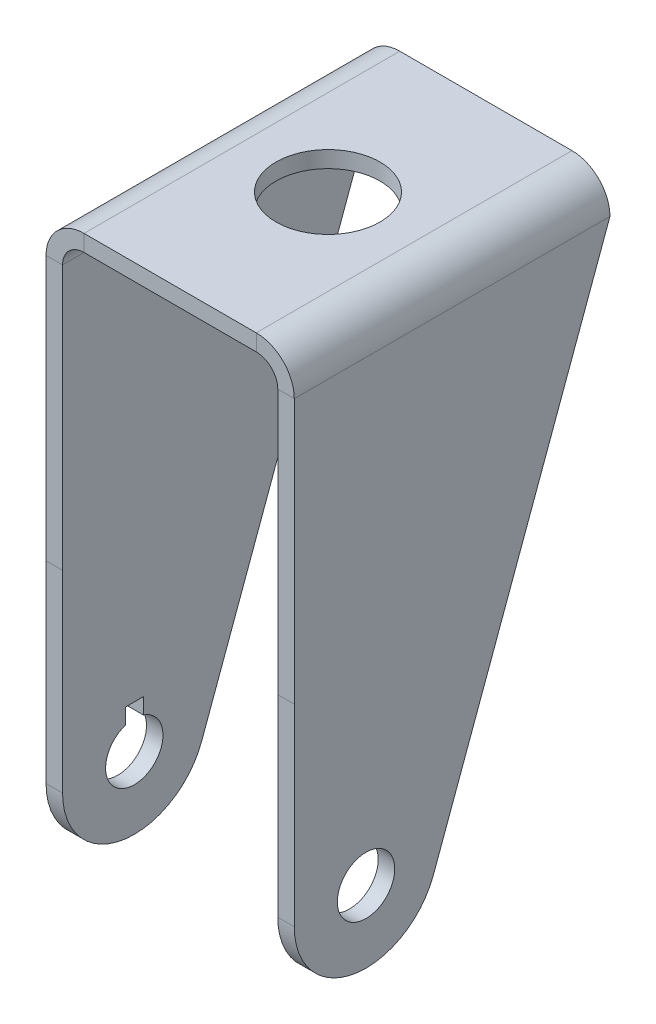
ISO-10303-21;
HEADER;
FILE_DESCRIPTION(('STEP AP214'),'2;1');
FILE_NAME('part.step','',(''),(''),'','','');
FILE_SCHEMA(('AUTOMOTIVE_DESIGN { 1 0 10303 214 1 1 1 1 }'));
ENDSEC;
DATA;
#1=APPLICATION_CONTEXT('core data for automotive mechanical design processes');
#2=APPLICATION_PROTOCOL_DEFINITION('international standard','automotive_design',2000,#1);
#3=PRODUCT_CONTEXT('',#1,'mechanical');
#4=PRODUCT('Part','Part','',(#3));
#5=PRODUCT_RELATED_PRODUCT_CATEGORY('part','',(#4));
#6=PRODUCT_DEFINITION_FORMATION('','',#4);
#7=PRODUCT_DEFINITION_CONTEXT('part definition',#1,'design');
#8=PRODUCT_DEFINITION('design','',#6,#7);
#9=PRODUCT_DEFINITION_SHAPE('','',#8);
#10=(LENGTH_UNIT() NAMED_UNIT(*) SI_UNIT(.MILLI.,.METRE.));
#11=(NAMED_UNIT(*) PLANE_ANGLE_UNIT() SI_UNIT($,.RADIAN.));
#12=(NAMED_UNIT(*) SI_UNIT($,.STERADIAN.) SOLID_ANGLE_UNIT());
#13=UNCERTAINTY_MEASURE_WITH_UNIT(LENGTH_MEASURE(1.E-05),#10,'distance_accuracy_value','');
#14=(GEOMETRIC_REPRESENTATION_CONTEXT(3) GLOBAL_UNCERTAINTY_ASSIGNED_CONTEXT((#13)) GLOBAL_UNIT_ASSIGNED_CONTEXT((#10,
#11,#12)) REPRESENTATION_CONTEXT('',''));
#15=CARTESIAN_POINT('',(0.,0.,0.));
#16=DIRECTION('',(0.,0.,1.));
#17=DIRECTION('',(1.,0.,0.));
#18=AXIS2_PLACEMENT_3D('',#15,#16,#17);
#19=CARTESIAN_POINT('',(-12.,79.05,44.));
#20=DIRECTION('',(0.,0.,1.));
#21=DIRECTION('',(1.,0.,0.));
#22=AXIS2_PLACEMENT_3D('',#19,#20,#21);
#23=PLANE('',#22);
#24=DIRECTION('',(0.,1.,0.));
#25=VECTOR('',#24,1.);
#26=CARTESIAN_POINT('',(-17.3,76.75,44.));
#27=LINE('',#26,#25);
#28=CARTESIAN_POINT('',(-17.3,36.875,44.));
#29=VERTEX_POINT('',#28);
#30=CARTESIAN_POINT('',(-17.3,73.75,44.));
#31=VERTEX_POINT('',#30);
#32=EDGE_CURVE('E251',#29,#31,#27,.T.);
#33=ORIENTED_EDGE('',*,*,#32,.F.);
#34=DIRECTION('',(1.,0.,0.));
#35=VECTOR('',#34,1.);
#36=CARTESIAN_POINT('',(-12.,36.875,44.));
#37=LINE('',#36,#35);
#38=CARTESIAN_POINT('',(-15.,36.875,44.));
#39=VERTEX_POINT('',#38);
#40=EDGE_CURVE('E64',#29,#39,#37,.T.);
#41=ORIENTED_EDGE('',*,*,#40,.T.);
#42=DIRECTION('',(0.,1.,0.));
#43=VECTOR('',#42,1.);
#44=CARTESIAN_POINT('',(-15.,76.75,44.));
#45=LINE('',#44,#43);
#46=CARTESIAN_POINT('',(-15.,73.75,44.));
#47=VERTEX_POINT('',#46);
#48=EDGE_CURVE('E254',#39,#47,#45,.T.);
#49=ORIENTED_EDGE('',*,*,#48,.T.);
#50=DIRECTION('',(-1.,0.,0.));
#51=VECTOR('',#50,1.);
#52=CARTESIAN_POINT('',(-15.,73.75,44.));
#53=LINE('',#52,#51);
#54=EDGE_CURVE('E321',#47,#31,#53,.T.);
#55=ORIENTED_EDGE('',*,*,#54,.T.);
#56=EDGE_LOOP('',(#33,#41,#49,#55));
#57=FACE_BOUND('',#56,.T.);
#58=ADVANCED_FACE('F41',(#57),#23,.T.);
#59=CARTESIAN_POINT('',(15.,76.75,44.));
#60=DIRECTION('',(1.,0.,0.));
#61=DIRECTION('',(0.,1.,0.));
#62=AXIS2_PLACEMENT_3D('',#59,#60,#61);
#63=PLANE('',#62);
#64=CARTESIAN_POINT('',(15.,9.99999999999999,34.));
#65=DIRECTION('',(1.,0.,0.));
#66=DIRECTION('',(0.,1.,0.));
#67=AXIS2_PLACEMENT_3D('',#64,#65,#66);
#68=CIRCLE('',#67,4.);
#69=CARTESIAN_POINT('',(15.,14.,34.));
#70=VERTEX_POINT('',#69);
#71=EDGE_CURVE('E205',#70,#70,#68,.T.);
#72=ORIENTED_EDGE('',*,*,#71,.T.);
#73=EDGE_LOOP('',(#72));
#74=FACE_BOUND('',#73,.T.);
#75=DIRECTION('',(0.,0.938993836890136,-0.343933967910034));
#76=VECTOR('',#75,1.);
#77=CARTESIAN_POINT('',(15.,62.1852457259066,4.23592963992889));
#78=LINE('',#77,#76);
#79=CARTESIAN_POINT('',(15.,6.56066032089966,24.6100616310986));
#80=VERTEX_POINT('',#79);
#81=CARTESIAN_POINT('',(15.,73.75,0.));
#82=VERTEX_POINT('',#81);
#83=EDGE_CURVE('E222',#80,#82,#78,.T.);
#84=ORIENTED_EDGE('',*,*,#83,.F.);
#85=CARTESIAN_POINT('',(15.,9.99999999999999,34.));
#86=DIRECTION('',(1.,0.,0.));
#87=DIRECTION('',(0.,1.,0.));
#88=AXIS2_PLACEMENT_3D('',#85,#86,#87);
#89=CIRCLE('',#88,9.99999999999999);
#90=CARTESIAN_POINT('',(15.,9.99999999999999,44.));
#91=VERTEX_POINT('',#90);
#92=EDGE_CURVE('E231',#91,#80,#89,.T.);
#93=ORIENTED_EDGE('',*,*,#92,.F.);
#94=DIRECTION('',(0.,-1.,0.));
#95=VECTOR('',#94,1.);
#96=CARTESIAN_POINT('',(15.,76.75,44.));
#97=LINE('',#96,#95);
#98=CARTESIAN_POINT('',(15.,36.875,44.));
#99=VERTEX_POINT('',#98);
#100=EDGE_CURVE('E238',#99,#91,#97,.T.);
#101=ORIENTED_EDGE('',*,*,#100,.F.);
#102=CARTESIAN_POINT('',(15.,73.75,44.));
#103=VERTEX_POINT('',#102);
#104=EDGE_CURVE('E234',#103,#99,#97,.T.);
#105=ORIENTED_EDGE('',*,*,#104,.F.);
#106=DIRECTION('',(0.,0.,-1.));
#107=VECTOR('',#106,1.);
#108=CARTESIAN_POINT('',(15.,73.75,44.));
#109=LINE('',#108,#107);
#110=EDGE_CURVE('E266',#103,#82,#109,.T.);
#111=ORIENTED_EDGE('',*,*,#110,.T.);
#112=EDGE_LOOP('',(#84,#93,#101,#105,#111));
#113=FACE_BOUND('',#112,.T.);
#114=ADVANCED_FACE('F420',(#74,#113),#63,.F.);
#115=CARTESIAN_POINT('',(17.3,76.75,44.));
#116=DIRECTION('',(1.,0.,0.));
#117=DIRECTION('',(0.,1.,0.));
#118=AXIS2_PLACEMENT_3D('',#115,#116,#117);
#119=PLANE('',#118);
#120=CARTESIAN_POINT('',(17.3,9.99999999999999,34.));
#121=DIRECTION('',(1.,0.,0.));
#122=DIRECTION('',(0.,1.,0.));
#123=AXIS2_PLACEMENT_3D('',#120,#121,#122);
#124=CIRCLE('',#123,4.);
#125=CARTESIAN_POINT('',(17.3,14.,34.));
#126=VERTEX_POINT('',#125);
#127=EDGE_CURVE('E199',#126,#126,#124,.T.);
#128=ORIENTED_EDGE('',*,*,#127,.F.);
#129=EDGE_LOOP('',(#128));
#130=FACE_BOUND('',#129,.T.);
#131=CARTESIAN_POINT('',(17.3,9.99999999999999,34.));
#132=DIRECTION('',(1.,0.,0.));
#133=DIRECTION('',(0.,1.,0.));
#134=AXIS2_PLACEMENT_3D('',#131,#132,#133);
#135=CIRCLE('',#134,9.99999999999999);
#136=CARTESIAN_POINT('',(17.3,9.99999999999999,44.));
#137=VERTEX_POINT('',#136);
#138=CARTESIAN_POINT('',(17.3,6.56066032089966,24.6100616310986));
#139=VERTEX_POINT('',#138);
#140=EDGE_CURVE('E229',#137,#139,#135,.T.);
#141=ORIENTED_EDGE('',*,*,#140,.T.);
#142=DIRECTION('',(0.,0.938993836890136,-0.343933967910034));
#143=VECTOR('',#142,1.);
#144=CARTESIAN_POINT('',(17.3,62.1852457259066,4.23592963992889));
#145=LINE('',#144,#143);
#146=CARTESIAN_POINT('',(17.3,73.75,0.));
#147=VERTEX_POINT('',#146);
#148=EDGE_CURVE('E219',#139,#147,#145,.T.);
#149=ORIENTED_EDGE('',*,*,#148,.T.);
#150=DIRECTION('',(0.,0.,-1.));
#151=VECTOR('',#150,1.);
#152=CARTESIAN_POINT('',(17.3,73.75,44.));
#153=LINE('',#152,#151);
#154=CARTESIAN_POINT('',(17.3,73.75,44.));
#155=VERTEX_POINT('',#154);
#156=EDGE_CURVE('E304',#155,#147,#153,.T.);
#157=ORIENTED_EDGE('',*,*,#156,.F.);
#158=DIRECTION('',(0.,-1.,0.));
#159=VECTOR('',#158,1.);
#160=CARTESIAN_POINT('',(17.3,76.75,44.));
#161=LINE('',#160,#159);
#162=CARTESIAN_POINT('',(17.3,36.875,44.));
#163=VERTEX_POINT('',#162);
#164=EDGE_CURVE('E239',#155,#163,#161,.T.);
#165=ORIENTED_EDGE('',*,*,#164,.T.);
#166=EDGE_CURVE('E237',#163,#137,#161,.T.);
#167=ORIENTED_EDGE('',*,*,#166,.T.);
#168=EDGE_LOOP('',(#141,#149,#157,#165,#167));
#169=FACE_BOUND('',#168,.T.);
#170=ADVANCED_FACE('F424',(#130,#169),#119,.T.);
#171=CARTESIAN_POINT('',(-17.3,76.75,44.));
#172=DIRECTION('',(-1.,0.,0.));
#173=DIRECTION('',(0.,-1.,0.));
#174=AXIS2_PLACEMENT_3D('',#171,#172,#173);
#175=PLANE('',#174);
#176=DIRECTION('',(0.,-1.,0.));
#177=VECTOR('',#176,1.);
#178=CARTESIAN_POINT('',(-17.3,16.,32.75));
#179=LINE('',#178,#177);
#180=CARTESIAN_POINT('',(-17.3,16.,32.75));
#181=VERTEX_POINT('',#180);
#182=CARTESIAN_POINT('',(-17.3,13.7996710383927,32.75));
#183=VERTEX_POINT('',#182);
#184=EDGE_CURVE('E183',#181,#183,#179,.T.);
#185=ORIENTED_EDGE('',*,*,#184,.F.);
#186=DIRECTION('',(0.,0.,-1.));
#187=VECTOR('',#186,1.);
#188=CARTESIAN_POINT('',(-17.3,16.,35.25));
#189=LINE('',#188,#187);
#190=CARTESIAN_POINT('',(-17.3,16.,35.25));
#191=VERTEX_POINT('',#190);
#192=EDGE_CURVE('E172',#191,#181,#189,.T.);
#193=ORIENTED_EDGE('',*,*,#192,.F.);
#194=DIRECTION('',(0.,1.,0.));
#195=VECTOR('',#194,1.);
#196=CARTESIAN_POINT('',(-17.3,16.,35.25));
#197=LINE('',#196,#195);
#198=CARTESIAN_POINT('',(-17.3,13.7996710383927,35.25));
#199=VERTEX_POINT('',#198);
#200=EDGE_CURVE('E177',#199,#191,#197,.T.);
#201=ORIENTED_EDGE('',*,*,#200,.F.);
#202=CARTESIAN_POINT('',(-17.3,9.99999999999999,34.));
#203=DIRECTION('',(-1.,0.,0.));
#204=DIRECTION('',(0.,-1.,0.));
#205=AXIS2_PLACEMENT_3D('',#202,#203,#204);
#206=CIRCLE('',#205,4.);
#207=EDGE_CURVE('E203',#183,#199,#206,.T.);
#208=ORIENTED_EDGE('',*,*,#207,.F.);
#209=EDGE_LOOP('',(#185,#193,#201,#208));
#210=FACE_BOUND('',#209,.T.);
#211=DIRECTION('',(0.,0.,-1.));
#212=VECTOR('',#211,1.);
#213=CARTESIAN_POINT('',(-17.3,73.75,44.));
#214=LINE('',#213,#212);
#215=CARTESIAN_POINT('',(-17.3,73.75,0.));
#216=VERTEX_POINT('',#215);
#217=EDGE_CURVE('E295',#31,#216,#214,.T.);
#218=ORIENTED_EDGE('',*,*,#217,.T.);
#219=DIRECTION('',(0.,-0.938993836890136,0.343933967910034));
#220=VECTOR('',#219,1.);
#221=CARTESIAN_POINT('',(-17.3,62.1852457259066,4.23592963992889));
#222=LINE('',#221,#220);
#223=CARTESIAN_POINT('',(-17.3,6.56066032089966,24.6100616310986));
#224=VERTEX_POINT('',#223);
#225=EDGE_CURVE('E216',#216,#224,#222,.T.);
#226=ORIENTED_EDGE('',*,*,#225,.T.);
#227=CARTESIAN_POINT('',(-17.3,9.99999999999999,34.));
#228=DIRECTION('',(-1.,0.,0.));
#229=DIRECTION('',(0.,-1.,0.));
#230=AXIS2_PLACEMENT_3D('',#227,#228,#229);
#231=CIRCLE('',#230,9.99999999999999);
#232=CARTESIAN_POINT('',(-17.3,9.99999999999999,44.));
#233=VERTEX_POINT('',#232);
#234=EDGE_CURVE('E226',#224,#233,#231,.T.);
#235=ORIENTED_EDGE('',*,*,#234,.T.);
#236=EDGE_CURVE('E253',#233,#29,#27,.T.);
#237=ORIENTED_EDGE('',*,*,#236,.T.);
#238=ORIENTED_EDGE('',*,*,#32,.T.);
#239=EDGE_LOOP('',(#218,#226,#235,#237,#238));
#240=FACE_BOUND('',#239,.T.);
#241=ADVANCED_FACE('F185',(#210,#240),#175,.T.);
#242=CARTESIAN_POINT('',(-15.,76.75,44.));
#243=DIRECTION('',(-1.,0.,0.));
#244=DIRECTION('',(0.,-1.,0.));
#245=AXIS2_PLACEMENT_3D('',#242,#243,#244);
#246=PLANE('',#245);
#247=DIRECTION('',(0.,0.,-1.));
#248=VECTOR('',#247,1.);
#249=CARTESIAN_POINT('',(-15.,16.,44.));
#250=LINE('',#249,#248);
#251=CARTESIAN_POINT('',(-15.,16.,35.25));
#252=VERTEX_POINT('',#251);
#253=CARTESIAN_POINT('',(-15.,16.,32.75));
#254=VERTEX_POINT('',#253);
#255=EDGE_CURVE('E11',#252,#254,#250,.T.);
#256=ORIENTED_EDGE('',*,*,#255,.T.);
#257=DIRECTION('',(0.,-1.,0.));
#258=VECTOR('',#257,1.);
#259=CARTESIAN_POINT('',(-15.,76.75,32.75));
#260=LINE('',#259,#258);
#261=CARTESIAN_POINT('',(-15.,13.7996710383927,32.75));
#262=VERTEX_POINT('',#261);
#263=EDGE_CURVE('E192',#254,#262,#260,.T.);
#264=ORIENTED_EDGE('',*,*,#263,.T.);
#265=CARTESIAN_POINT('',(-15.,9.99999999999999,34.));
#266=DIRECTION('',(-1.,0.,0.));
#267=DIRECTION('',(0.,-1.,0.));
#268=AXIS2_PLACEMENT_3D('',#265,#266,#267);
#269=CIRCLE('',#268,4.);
#270=CARTESIAN_POINT('',(-15.,13.7996710383927,35.25));
#271=VERTEX_POINT('',#270);
#272=EDGE_CURVE('E202',#262,#271,#269,.T.);
#273=ORIENTED_EDGE('',*,*,#272,.T.);
#274=DIRECTION('',(0.,1.,0.));
#275=VECTOR('',#274,1.);
#276=CARTESIAN_POINT('',(-15.,76.75,35.25));
#277=LINE('',#276,#275);
#278=EDGE_CURVE('E56',#271,#252,#277,.T.);
#279=ORIENTED_EDGE('',*,*,#278,.T.);
#280=EDGE_LOOP('',(#256,#264,#273,#279));
#281=FACE_BOUND('',#280,.T.);
#282=DIRECTION('',(0.,-0.938993836890136,0.343933967910034));
#283=VECTOR('',#282,1.);
#284=CARTESIAN_POINT('',(-15.,62.1852457259066,4.23592963992889));
#285=LINE('',#284,#283);
#286=CARTESIAN_POINT('',(-15.,73.75,0.));
#287=VERTEX_POINT('',#286);
#288=CARTESIAN_POINT('',(-15.,6.56066032089966,24.6100616310986));
#289=VERTEX_POINT('',#288);
#290=EDGE_CURVE('E214',#287,#289,#285,.T.);
#291=ORIENTED_EDGE('',*,*,#290,.F.);
#292=DIRECTION('',(0.,0.,-1.));
#293=VECTOR('',#292,1.);
#294=CARTESIAN_POINT('',(-15.,73.75,44.));
#295=LINE('',#294,#293);
#296=EDGE_CURVE('E292',#47,#287,#295,.T.);
#297=ORIENTED_EDGE('',*,*,#296,.F.);
#298=ORIENTED_EDGE('',*,*,#48,.F.);
#299=CARTESIAN_POINT('',(-15.,9.99999999999999,44.));
#300=VERTEX_POINT('',#299);
#301=EDGE_CURVE('E256',#300,#39,#45,.T.);
#302=ORIENTED_EDGE('',*,*,#301,.F.);
#303=CARTESIAN_POINT('',(-15.,9.99999999999999,34.));
#304=DIRECTION('',(-1.,0.,0.));
#305=DIRECTION('',(0.,-1.,0.));
#306=AXIS2_PLACEMENT_3D('',#303,#304,#305);
#307=CIRCLE('',#306,9.99999999999999);
#308=EDGE_CURVE('E224',#289,#300,#307,.T.);
#309=ORIENTED_EDGE('',*,*,#308,.F.);
#310=EDGE_LOOP('',(#291,#297,#298,#302,#309));
#311=FACE_BOUND('',#310,.T.);
#312=ADVANCED_FACE('F340',(#281,#311),#246,.F.);
#313=CARTESIAN_POINT('',(12.,73.75,44.));
#314=DIRECTION('',(0.,0.,1.));
#315=DIRECTION('',(1.,0.,0.));
#316=AXIS2_PLACEMENT_3D('',#313,#314,#315);
#317=PLANE('',#316);
#318=ORIENTED_EDGE('',*,*,#104,.T.);
#319=DIRECTION('',(1.,0.,0.));
#320=VECTOR('',#319,1.);
#321=CARTESIAN_POINT('',(12.,36.875,44.));
#322=LINE('',#321,#320);
#323=EDGE_CURVE('E324',#99,#163,#322,.T.);
#324=ORIENTED_EDGE('',*,*,#323,.T.);
#325=ORIENTED_EDGE('',*,*,#164,.F.);
#326=DIRECTION('',(-1.,0.,0.));
#327=VECTOR('',#326,1.);
#328=CARTESIAN_POINT('',(17.3,73.75,44.));
#329=LINE('',#328,#327);
#330=EDGE_CURVE('E311',#155,#103,#329,.T.);
#331=ORIENTED_EDGE('',*,*,#330,.T.);
#332=EDGE_LOOP('',(#318,#324,#325,#331));
#333=FACE_BOUND('',#332,.T.);
#334=ADVANCED_FACE('F343',(#333),#317,.T.);
#335=CARTESIAN_POINT('',(-15.,73.75,44.));
#336=DIRECTION('',(0.,0.,1.));
#337=DIRECTION('',(1.,0.,0.));
#338=AXIS2_PLACEMENT_3D('',#335,#336,#337);
#339=PLANE('',#338);
#340=ORIENTED_EDGE('',*,*,#54,.F.);
#341=CARTESIAN_POINT('',(-12.,73.75,44.));
#342=DIRECTION('',(0.,0.,1.));
#343=DIRECTION('',(1.,0.,0.));
#344=AXIS2_PLACEMENT_3D('',#341,#342,#343);
#345=CIRCLE('',#344,3.);
#346=CARTESIAN_POINT('',(-12.,76.75,44.));
#347=VERTEX_POINT('',#346);
#348=EDGE_CURVE('E257',#47,#347,#345,.F.);
#349=ORIENTED_EDGE('',*,*,#348,.T.);
#350=DIRECTION('',(0.,-1.,0.));
#351=VECTOR('',#350,1.);
#352=CARTESIAN_POINT('',(-12.,79.05,44.));
#353=LINE('',#352,#351);
#354=CARTESIAN_POINT('',(-12.,79.05,44.));
#355=VERTEX_POINT('',#354);
#356=EDGE_CURVE('E319',#355,#347,#353,.T.);
#357=ORIENTED_EDGE('',*,*,#356,.F.);
#358=CARTESIAN_POINT('',(-12.,73.75,44.));
#359=DIRECTION('',(0.,0.,1.));
#360=DIRECTION('',(1.,0.,0.));
#361=AXIS2_PLACEMENT_3D('',#358,#359,#360);
#362=CIRCLE('',#361,5.3);
#363=EDGE_CURVE('E248',#31,#355,#362,.F.);
#364=ORIENTED_EDGE('',*,*,#363,.F.);
#365=EDGE_LOOP('',(#340,#349,#357,#364));
#366=FACE_BOUND('',#365,.T.);
#367=ADVANCED_FACE('F43',(#366),#339,.T.);
#368=DIRECTION('',(-1.,0.,0.));
#369=VECTOR('',#368,1.);
#370=CARTESIAN_POINT('',(57.,9.99999999999999,44.));
#371=LINE('',#370,#369);
#372=EDGE_CURVE('E208',#300,#233,#371,.T.);
#373=ORIENTED_EDGE('',*,*,#372,.F.);
#374=ORIENTED_EDGE('',*,*,#301,.T.);
#375=ORIENTED_EDGE('',*,*,#40,.F.);
#376=ORIENTED_EDGE('',*,*,#236,.F.);
#377=EDGE_LOOP('',(#373,#374,#375,#376));
#378=FACE_BOUND('',#377,.T.);
#379=ADVANCED_FACE('F401',(#378),#23,.T.);
#380=CARTESIAN_POINT('',(-12.,76.75,0.));
#381=DIRECTION('',(0.,0.,-1.));
#382=DIRECTION('',(-1.,0.,0.));
#383=AXIS2_PLACEMENT_3D('',#380,#381,#382);
#384=PLANE('',#383);
#385=DIRECTION('',(0.,1.,0.));
#386=VECTOR('',#385,1.);
#387=CARTESIAN_POINT('',(-12.,76.75,0.));
#388=LINE('',#387,#386);
#389=CARTESIAN_POINT('',(-12.,76.75,0.));
#390=VERTEX_POINT('',#389);
#391=CARTESIAN_POINT('',(-12.,79.05,0.));
#392=VERTEX_POINT('',#391);
#393=EDGE_CURVE('E317',#390,#392,#388,.T.);
#394=ORIENTED_EDGE('',*,*,#393,.F.);
#395=CARTESIAN_POINT('',(-12.,73.75,0.));
#396=DIRECTION('',(0.,0.,1.));
#397=DIRECTION('',(1.,0.,0.));
#398=AXIS2_PLACEMENT_3D('',#395,#396,#397);
#399=CIRCLE('',#398,3.);
#400=EDGE_CURVE('E275',#287,#390,#399,.F.);
#401=ORIENTED_EDGE('',*,*,#400,.F.);
#402=DIRECTION('',(1.,0.,0.));
#403=VECTOR('',#402,1.);
#404=CARTESIAN_POINT('',(-17.3,73.75,0.));
#405=LINE('',#404,#403);
#406=EDGE_CURVE('E315',#216,#287,#405,.T.);
#407=ORIENTED_EDGE('',*,*,#406,.F.);
#408=CARTESIAN_POINT('',(-12.,73.75,0.));
#409=DIRECTION('',(0.,0.,1.));
#410=DIRECTION('',(1.,0.,0.));
#411=AXIS2_PLACEMENT_3D('',#408,#409,#410);
#412=CIRCLE('',#411,5.3);
#413=EDGE_CURVE('E272',#216,#392,#412,.F.);
#414=ORIENTED_EDGE('',*,*,#413,.T.);
#415=EDGE_LOOP('',(#394,#401,#407,#414));
#416=FACE_BOUND('',#415,.T.);
#417=ADVANCED_FACE('F359',(#416),#384,.T.);
#418=CARTESIAN_POINT('',(-17.3,73.75,0.));
#419=DIRECTION('',(0.,0.,-1.));
#420=DIRECTION('',(-1.,0.,0.));
#421=AXIS2_PLACEMENT_3D('',#418,#419,#420);
#422=PLANE('',#421);
#423=DIRECTION('',(1.,0.,0.));
#424=VECTOR('',#423,1.);
#425=CARTESIAN_POINT('',(15.,76.75,0.));
#426=LINE('',#425,#424);
#427=CARTESIAN_POINT('',(12.,76.75,0.));
#428=VERTEX_POINT('',#427);
#429=EDGE_CURVE('E278',#390,#428,#426,.T.);
#430=ORIENTED_EDGE('',*,*,#429,.F.);
#431=ORIENTED_EDGE('',*,*,#393,.T.);
#432=DIRECTION('',(1.,0.,0.));
#433=VECTOR('',#432,1.);
#434=CARTESIAN_POINT('',(15.,79.05,0.));
#435=LINE('',#434,#433);
#436=CARTESIAN_POINT('',(12.,79.05,0.));
#437=VERTEX_POINT('',#436);
#438=EDGE_CURVE('E269',#392,#437,#435,.T.);
#439=ORIENTED_EDGE('',*,*,#438,.T.);
#440=DIRECTION('',(0.,-1.,0.));
#441=VECTOR('',#440,1.);
#442=CARTESIAN_POINT('',(12.,79.05,0.));
#443=LINE('',#442,#441);
#444=EDGE_CURVE('E307',#437,#428,#443,.T.);
#445=ORIENTED_EDGE('',*,*,#444,.T.);
#446=EDGE_LOOP('',(#430,#431,#439,#445));
#447=FACE_BOUND('',#446,.T.);
#448=ADVANCED_FACE('F363',(#447),#422,.T.);
#449=CARTESIAN_POINT('',(12.,76.75,44.));
#450=DIRECTION('',(0.,0.,1.));
#451=DIRECTION('',(1.,0.,0.));
#452=AXIS2_PLACEMENT_3D('',#449,#450,#451);
#453=PLANE('',#452);
#454=DIRECTION('',(0.,1.,0.));
#455=VECTOR('',#454,1.);
#456=CARTESIAN_POINT('',(12.,76.75,44.));
#457=LINE('',#456,#455);
#458=CARTESIAN_POINT('',(12.,76.75,44.));
#459=VERTEX_POINT('',#458);
#460=CARTESIAN_POINT('',(12.,79.05,44.));
#461=VERTEX_POINT('',#460);
#462=EDGE_CURVE('E313',#459,#461,#457,.T.);
#463=ORIENTED_EDGE('',*,*,#462,.F.);
#464=CARTESIAN_POINT('',(12.,73.75,44.));
#465=DIRECTION('',(0.,0.,1.));
#466=DIRECTION('',(1.,0.,0.));
#467=AXIS2_PLACEMENT_3D('',#464,#465,#466);
#468=CIRCLE('',#467,3.);
#469=EDGE_CURVE('E263',#459,#103,#468,.F.);
#470=ORIENTED_EDGE('',*,*,#469,.T.);
#471=ORIENTED_EDGE('',*,*,#330,.F.);
#472=CARTESIAN_POINT('',(12.,73.75,44.));
#473=DIRECTION('',(0.,0.,1.));
#474=DIRECTION('',(1.,0.,0.));
#475=AXIS2_PLACEMENT_3D('',#472,#473,#474);
#476=CIRCLE('',#475,5.3);
#477=EDGE_CURVE('E242',#461,#155,#476,.F.);
#478=ORIENTED_EDGE('',*,*,#477,.F.);
#479=EDGE_LOOP('',(#463,#470,#471,#478));
#480=FACE_BOUND('',#479,.T.);
#481=ADVANCED_FACE('F393',(#480),#453,.T.);
#482=CARTESIAN_POINT('',(17.3,73.75,44.));
#483=DIRECTION('',(0.,0.,1.));
#484=DIRECTION('',(1.,0.,0.));
#485=AXIS2_PLACEMENT_3D('',#482,#483,#484);
#486=PLANE('',#485);
#487=DIRECTION('',(1.,0.,0.));
#488=VECTOR('',#487,1.);
#489=CARTESIAN_POINT('',(15.,76.75,44.));
#490=LINE('',#489,#488);
#491=EDGE_CURVE('E260',#347,#459,#490,.T.);
#492=ORIENTED_EDGE('',*,*,#491,.T.);
#493=ORIENTED_EDGE('',*,*,#462,.T.);
#494=DIRECTION('',(1.,0.,0.));
#495=VECTOR('',#494,1.);
#496=CARTESIAN_POINT('',(15.,79.05,44.));
#497=LINE('',#496,#495);
#498=EDGE_CURVE('E245',#355,#461,#497,.T.);
#499=ORIENTED_EDGE('',*,*,#498,.F.);
#500=ORIENTED_EDGE('',*,*,#356,.T.);
#501=EDGE_LOOP('',(#492,#493,#499,#500));
#502=FACE_BOUND('',#501,.T.);
#503=ADVANCED_FACE('F395',(#502),#486,.T.);
#504=CARTESIAN_POINT('',(15.,73.75,0.));
#505=DIRECTION('',(0.,0.,-1.));
#506=DIRECTION('',(-1.,0.,0.));
#507=AXIS2_PLACEMENT_3D('',#504,#505,#506);
#508=PLANE('',#507);
#509=DIRECTION('',(1.,0.,0.));
#510=VECTOR('',#509,1.);
#511=CARTESIAN_POINT('',(15.,73.75,0.));
#512=LINE('',#511,#510);
#513=EDGE_CURVE('E309',#82,#147,#512,.T.);
#514=ORIENTED_EDGE('',*,*,#513,.F.);
#515=CARTESIAN_POINT('',(12.,73.75,0.));
#516=DIRECTION('',(0.,0.,1.));
#517=DIRECTION('',(1.,0.,0.));
#518=AXIS2_PLACEMENT_3D('',#515,#516,#517);
#519=CIRCLE('',#518,3.);
#520=EDGE_CURVE('E281',#428,#82,#519,.F.);
#521=ORIENTED_EDGE('',*,*,#520,.F.);
#522=ORIENTED_EDGE('',*,*,#444,.F.);
#523=CARTESIAN_POINT('',(12.,73.75,0.));
#524=DIRECTION('',(0.,0.,1.));
#525=DIRECTION('',(1.,0.,0.));
#526=AXIS2_PLACEMENT_3D('',#523,#524,#525);
#527=CIRCLE('',#526,5.3);
#528=EDGE_CURVE('E233',#437,#147,#527,.F.);
#529=ORIENTED_EDGE('',*,*,#528,.T.);
#530=EDGE_LOOP('',(#514,#521,#522,#529));
#531=FACE_BOUND('',#530,.T.);
#532=ADVANCED_FACE('F381',(#531),#508,.T.);
#533=CARTESIAN_POINT('',(12.,73.75,44.));
#534=DIRECTION('',(0.,0.,-1.));
#535=DIRECTION('',(-1.,0.,0.));
#536=AXIS2_PLACEMENT_3D('',#533,#534,#535);
#537=CYLINDRICAL_SURFACE('',#536,5.3);
#538=ORIENTED_EDGE('',*,*,#528,.F.);
#539=DIRECTION('',(0.,0.,-1.));
#540=VECTOR('',#539,1.);
#541=CARTESIAN_POINT('',(12.,79.05,44.));
#542=LINE('',#541,#540);
#543=EDGE_CURVE('E301',#461,#437,#542,.T.);
#544=ORIENTED_EDGE('',*,*,#543,.F.);
#545=ORIENTED_EDGE('',*,*,#477,.T.);
#546=ORIENTED_EDGE('',*,*,#156,.T.);
#547=EDGE_LOOP('',(#538,#544,#545,#546));
#548=FACE_BOUND('',#547,.T.);
#549=ADVANCED_FACE('F377',(#548),#537,.T.);
#550=CARTESIAN_POINT('',(15.,79.05,44.));
#551=DIRECTION('',(0.,1.,0.));
#552=DIRECTION('',(0.,0.,1.));
#553=AXIS2_PLACEMENT_3D('',#550,#551,#552);
#554=PLANE('',#553);
#555=CARTESIAN_POINT('',(0.,79.05,22.));
#556=DIRECTION('',(0.,1.,0.));
#557=DIRECTION('',(0.,0.,1.));
#558=AXIS2_PLACEMENT_3D('',#555,#556,#557);
#559=CIRCLE('',#558,7.25);
#560=CARTESIAN_POINT('',(0.,79.05,29.25));
#561=VERTEX_POINT('',#560);
#562=EDGE_CURVE('E195',#561,#561,#559,.T.);
#563=ORIENTED_EDGE('',*,*,#562,.F.);
#564=EDGE_LOOP('',(#563));
#565=FACE_BOUND('',#564,.T.);
#566=ORIENTED_EDGE('',*,*,#438,.F.);
#567=DIRECTION('',(0.,0.,-1.));
#568=VECTOR('',#567,1.);
#569=CARTESIAN_POINT('',(-12.,79.05,44.));
#570=LINE('',#569,#568);
#571=EDGE_CURVE('E298',#355,#392,#570,.T.);
#572=ORIENTED_EDGE('',*,*,#571,.F.);
#573=ORIENTED_EDGE('',*,*,#498,.T.);
#574=ORIENTED_EDGE('',*,*,#543,.T.);
#575=EDGE_LOOP('',(#566,#572,#573,#574));
#576=FACE_BOUND('',#575,.T.);
#577=ADVANCED_FACE('F372',(#565,#576),#554,.T.);
#578=CARTESIAN_POINT('',(-12.,73.75,44.));
#579=DIRECTION('',(0.,0.,-1.));
#580=DIRECTION('',(-1.,0.,0.));
#581=AXIS2_PLACEMENT_3D('',#578,#579,#580);
#582=CYLINDRICAL_SURFACE('',#581,5.3);
#583=ORIENTED_EDGE('',*,*,#413,.F.);
#584=ORIENTED_EDGE('',*,*,#217,.F.);
#585=ORIENTED_EDGE('',*,*,#363,.T.);
#586=ORIENTED_EDGE('',*,*,#571,.T.);
#587=EDGE_LOOP('',(#583,#584,#585,#586));
#588=FACE_BOUND('',#587,.T.);
#589=ADVANCED_FACE('F367',(#588),#582,.T.);
#590=CARTESIAN_POINT('',(-12.,73.75,44.));
#591=DIRECTION('',(0.,0.,-1.));
#592=DIRECTION('',(-1.,0.,0.));
#593=AXIS2_PLACEMENT_3D('',#590,#591,#592);
#594=CYLINDRICAL_SURFACE('',#593,3.);
#595=ORIENTED_EDGE('',*,*,#400,.T.);
#596=DIRECTION('',(0.,0.,-1.));
#597=VECTOR('',#596,1.);
#598=CARTESIAN_POINT('',(-12.,76.75,44.));
#599=LINE('',#598,#597);
#600=EDGE_CURVE('E289',#347,#390,#599,.T.);
#601=ORIENTED_EDGE('',*,*,#600,.F.);
#602=ORIENTED_EDGE('',*,*,#348,.F.);
#603=ORIENTED_EDGE('',*,*,#296,.T.);
#604=EDGE_LOOP('',(#595,#601,#602,#603));
#605=FACE_BOUND('',#604,.T.);
#606=ADVANCED_FACE('F355',(#605),#594,.F.);
#607=CARTESIAN_POINT('',(15.,76.75,44.));
#608=DIRECTION('',(0.,1.,0.));
#609=DIRECTION('',(0.,0.,1.));
#610=AXIS2_PLACEMENT_3D('',#607,#608,#609);
#611=PLANE('',#610);
#612=CARTESIAN_POINT('',(0.,76.75,22.));
#613=DIRECTION('',(0.,1.,0.));
#614=DIRECTION('',(0.,0.,1.));
#615=AXIS2_PLACEMENT_3D('',#612,#613,#614);
#616=CIRCLE('',#615,7.25);
#617=CARTESIAN_POINT('',(0.,76.75,29.25));
#618=VERTEX_POINT('',#617);
#619=EDGE_CURVE('E198',#618,#618,#616,.T.);
#620=ORIENTED_EDGE('',*,*,#619,.T.);
#621=EDGE_LOOP('',(#620));
#622=FACE_BOUND('',#621,.T.);
#623=ORIENTED_EDGE('',*,*,#429,.T.);
#624=DIRECTION('',(0.,0.,-1.));
#625=VECTOR('',#624,1.);
#626=CARTESIAN_POINT('',(12.,76.75,44.));
#627=LINE('',#626,#625);
#628=EDGE_CURVE('E286',#459,#428,#627,.T.);
#629=ORIENTED_EDGE('',*,*,#628,.F.);
#630=ORIENTED_EDGE('',*,*,#491,.F.);
#631=ORIENTED_EDGE('',*,*,#600,.T.);
#632=EDGE_LOOP('',(#623,#629,#630,#631));
#633=FACE_BOUND('',#632,.T.);
#634=ADVANCED_FACE('F385',(#622,#633),#611,.F.);
#635=CARTESIAN_POINT('',(12.,73.75,44.));
#636=DIRECTION('',(0.,0.,-1.));
#637=DIRECTION('',(-1.,0.,0.));
#638=AXIS2_PLACEMENT_3D('',#635,#636,#637);
#639=CYLINDRICAL_SURFACE('',#638,3.);
#640=ORIENTED_EDGE('',*,*,#520,.T.);
#641=ORIENTED_EDGE('',*,*,#110,.F.);
#642=ORIENTED_EDGE('',*,*,#469,.F.);
#643=ORIENTED_EDGE('',*,*,#628,.T.);
#644=EDGE_LOOP('',(#640,#641,#642,#643));
#645=FACE_BOUND('',#644,.T.);
#646=ADVANCED_FACE('F389',(#645),#639,.F.);
#647=DIRECTION('',(-1.,0.,0.));
#648=VECTOR('',#647,1.);
#649=CARTESIAN_POINT('',(57.,9.99999999999999,44.));
#650=LINE('',#649,#648);
#651=EDGE_CURVE('E326',#137,#91,#650,.T.);
#652=ORIENTED_EDGE('',*,*,#651,.F.);
#653=ORIENTED_EDGE('',*,*,#166,.F.);
#654=ORIENTED_EDGE('',*,*,#323,.F.);
#655=ORIENTED_EDGE('',*,*,#100,.T.);
#656=EDGE_LOOP('',(#652,#653,#654,#655));
#657=FACE_BOUND('',#656,.T.);
#658=ADVANCED_FACE('F406',(#657),#317,.T.);
#659=CARTESIAN_POINT('',(57.,73.75,0.));
#660=DIRECTION('',(0.,-0.343933967910034,-0.938993836890136));
#661=DIRECTION('',(0.,0.938993836890136,-0.343933967910034));
#662=AXIS2_PLACEMENT_3D('',#659,#660,#661);
#663=PLANE('',#662);
#664=ORIENTED_EDGE('',*,*,#406,.T.);
#665=ORIENTED_EDGE('',*,*,#290,.T.);
#666=DIRECTION('',(-1.,0.,0.));
#667=VECTOR('',#666,1.);
#668=CARTESIAN_POINT('',(57.,6.56066032089966,24.6100616310986));
#669=LINE('',#668,#667);
#670=EDGE_CURVE('E210',#289,#224,#669,.T.);
#671=ORIENTED_EDGE('',*,*,#670,.T.);
#672=ORIENTED_EDGE('',*,*,#225,.F.);
#673=EDGE_LOOP('',(#664,#665,#671,#672));
#674=FACE_BOUND('',#673,.T.);
#675=ADVANCED_FACE('F404',(#674),#663,.T.);
#676=CARTESIAN_POINT('',(57.,9.99999999999999,34.));
#677=DIRECTION('',(-1.,0.,0.));
#678=DIRECTION('',(0.,0.,1.));
#679=AXIS2_PLACEMENT_3D('',#676,#677,#678);
#680=CYLINDRICAL_SURFACE('',#679,9.99999999999999);
#681=ORIENTED_EDGE('',*,*,#234,.F.);
#682=ORIENTED_EDGE('',*,*,#670,.F.);
#683=ORIENTED_EDGE('',*,*,#308,.T.);
#684=ORIENTED_EDGE('',*,*,#372,.T.);
#685=EDGE_LOOP('',(#681,#682,#683,#684));
#686=FACE_BOUND('',#685,.T.);
#687=ADVANCED_FACE('F403',(#686),#680,.T.);
#688=ORIENTED_EDGE('',*,*,#92,.T.);
#689=EDGE_CURVE('E213',#139,#80,#669,.T.);
#690=ORIENTED_EDGE('',*,*,#689,.F.);
#691=ORIENTED_EDGE('',*,*,#140,.F.);
#692=ORIENTED_EDGE('',*,*,#651,.T.);
#693=EDGE_LOOP('',(#688,#690,#691,#692));
#694=FACE_BOUND('',#693,.T.);
#695=ADVANCED_FACE('F413',(#694),#680,.T.);
#696=ORIENTED_EDGE('',*,*,#83,.T.);
#697=ORIENTED_EDGE('',*,*,#513,.T.);
#698=ORIENTED_EDGE('',*,*,#148,.F.);
#699=ORIENTED_EDGE('',*,*,#689,.T.);
#700=EDGE_LOOP('',(#696,#697,#698,#699));
#701=FACE_BOUND('',#700,.T.);
#702=ADVANCED_FACE('F408',(#701),#663,.T.);
#703=CARTESIAN_POINT('',(-24.7,9.99999999999999,34.));
#704=DIRECTION('',(1.,0.,0.));
#705=DIRECTION('',(0.,1.,0.));
#706=AXIS2_PLACEMENT_3D('',#703,#704,#705);
#707=CYLINDRICAL_SURFACE('',#706,4.);
#708=ORIENTED_EDGE('',*,*,#272,.F.);
#709=DIRECTION('',(1.,0.,0.));
#710=VECTOR('',#709,1.);
#711=CARTESIAN_POINT('',(-24.7,13.7996710383927,32.75));
#712=LINE('',#711,#710);
#713=EDGE_CURVE('E49',#262,#183,#712,.F.);
#714=ORIENTED_EDGE('',*,*,#713,.T.);
#715=ORIENTED_EDGE('',*,*,#207,.T.);
#716=DIRECTION('',(1.,0.,0.));
#717=VECTOR('',#716,1.);
#718=CARTESIAN_POINT('',(-24.7,13.7996710383927,35.25));
#719=LINE('',#718,#717);
#720=EDGE_CURVE('E179',#199,#271,#719,.T.);
#721=ORIENTED_EDGE('',*,*,#720,.T.);
#722=EDGE_LOOP('',(#708,#714,#715,#721));
#723=FACE_BOUND('',#722,.T.);
#724=ADVANCED_FACE('F336',(#723),#707,.F.);
#725=ORIENTED_EDGE('',*,*,#127,.T.);
#726=EDGE_LOOP('',(#725));
#727=FACE_BOUND('',#726,.T.);
#728=ORIENTED_EDGE('',*,*,#71,.F.);
#729=EDGE_LOOP('',(#728));
#730=FACE_BOUND('',#729,.T.);
#731=ADVANCED_FACE('F564',(#727,#730),#707,.F.);
#732=CARTESIAN_POINT('',(0.,37.05,22.));
#733=DIRECTION('',(0.,1.,0.));
#734=DIRECTION('',(0.,0.,1.));
#735=AXIS2_PLACEMENT_3D('',#732,#733,#734);
#736=CYLINDRICAL_SURFACE('',#735,7.25);
#737=ORIENTED_EDGE('',*,*,#562,.T.);
#738=EDGE_LOOP('',(#737));
#739=FACE_BOUND('',#738,.T.);
#740=ORIENTED_EDGE('',*,*,#619,.F.);
#741=EDGE_LOOP('',(#740));
#742=FACE_BOUND('',#741,.T.);
#743=ADVANCED_FACE('F568',(#739,#742),#736,.F.);
#744=CARTESIAN_POINT('',(-4.29999999999999,16.,35.25));
#745=DIRECTION('',(0.,1.,0.));
#746=DIRECTION('',(-1.,0.,0.));
#747=AXIS2_PLACEMENT_3D('',#744,#745,#746);
#748=PLANE('',#747);
#749=DIRECTION('',(-1.,0.,0.));
#750=VECTOR('',#749,1.);
#751=CARTESIAN_POINT('',(-4.29999999999999,16.,35.25));
#752=LINE('',#751,#750);
#753=EDGE_CURVE('E167',#252,#191,#752,.T.);
#754=ORIENTED_EDGE('',*,*,#753,.T.);
#755=ORIENTED_EDGE('',*,*,#192,.T.);
#756=DIRECTION('',(-1.,0.,0.));
#757=VECTOR('',#756,1.);
#758=CARTESIAN_POINT('',(-4.29999999999999,16.,32.75));
#759=LINE('',#758,#757);
#760=EDGE_CURVE('E174',#254,#181,#759,.T.);
#761=ORIENTED_EDGE('',*,*,#760,.F.);
#762=ORIENTED_EDGE('',*,*,#255,.F.);
#763=EDGE_LOOP('',(#754,#755,#761,#762));
#764=FACE_BOUND('',#763,.T.);
#765=ADVANCED_FACE('F169',(#764),#748,.F.);
#766=CARTESIAN_POINT('',(-4.29999999999999,16.,32.75));
#767=DIRECTION('',(0.,0.,-1.));
#768=DIRECTION('',(-1.,0.,0.));
#769=AXIS2_PLACEMENT_3D('',#766,#767,#768);
#770=PLANE('',#769);
#771=ORIENTED_EDGE('',*,*,#760,.T.);
#772=ORIENTED_EDGE('',*,*,#184,.T.);
#773=ORIENTED_EDGE('',*,*,#713,.F.);
#774=ORIENTED_EDGE('',*,*,#263,.F.);
#775=EDGE_LOOP('',(#771,#772,#773,#774));
#776=FACE_BOUND('',#775,.T.);
#777=ADVANCED_FACE('F338',(#776),#770,.F.);
#778=CARTESIAN_POINT('',(-4.29999999999999,16.,35.25));
#779=DIRECTION('',(0.,0.,1.));
#780=DIRECTION('',(1.,0.,0.));
#781=AXIS2_PLACEMENT_3D('',#778,#779,#780);
#782=PLANE('',#781);
#783=ORIENTED_EDGE('',*,*,#720,.F.);
#784=ORIENTED_EDGE('',*,*,#200,.T.);
#785=ORIENTED_EDGE('',*,*,#753,.F.);
#786=ORIENTED_EDGE('',*,*,#278,.F.);
#787=EDGE_LOOP('',(#783,#784,#785,#786));
#788=FACE_BOUND('',#787,.T.);
#789=ADVANCED_FACE('F178',(#788),#782,.F.);
#790=CLOSED_SHELL('',(#58,#114,#170,#241,#312,#334,#367,#379,#417,#448,#481,#503,#532,#549,#577,
#589,#606,#634,#646,#658,#675,#687,#695,#702,#724,#731,#743,#765,#777,#789));
#791=MANIFOLD_SOLID_BREP('B2',#790);
#792=ADVANCED_BREP_SHAPE_REPRESENTATION('',(#18,#791),#14);
#793=SHAPE_DEFINITION_REPRESENTATION(#9,#792);
ENDSEC;
END-ISO-10303-21;
